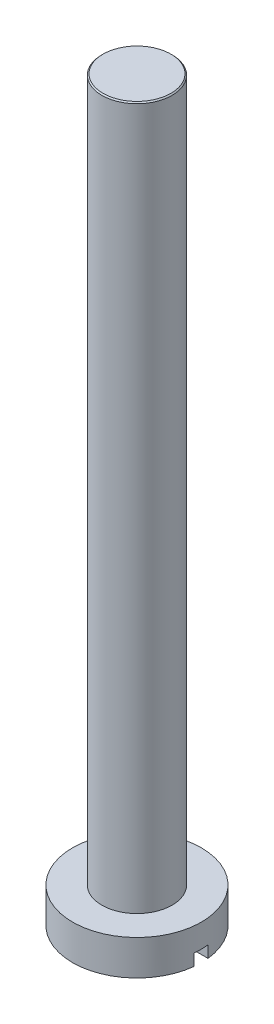
ISO-10303-21;
HEADER;
FILE_DESCRIPTION(('STEP AP214'),'2;1');
FILE_NAME('part.step','',(''),(''),'','','');
FILE_SCHEMA(('AUTOMOTIVE_DESIGN { 1 0 10303 214 1 1 1 1 }'));
ENDSEC;
DATA;
#1=APPLICATION_CONTEXT('core data for automotive mechanical design processes');
#2=APPLICATION_PROTOCOL_DEFINITION('international standard','automotive_design',2000,#1);
#3=PRODUCT_CONTEXT('',#1,'mechanical');
#4=PRODUCT('Part','Part','',(#3));
#5=PRODUCT_RELATED_PRODUCT_CATEGORY('part','',(#4));
#6=PRODUCT_DEFINITION_FORMATION('','',#4);
#7=PRODUCT_DEFINITION_CONTEXT('part definition',#1,'design');
#8=PRODUCT_DEFINITION('design','',#6,#7);
#9=PRODUCT_DEFINITION_SHAPE('','',#8);
#10=(LENGTH_UNIT() NAMED_UNIT(*) SI_UNIT(.MILLI.,.METRE.));
#11=(NAMED_UNIT(*) PLANE_ANGLE_UNIT() SI_UNIT($,.RADIAN.));
#12=(NAMED_UNIT(*) SI_UNIT($,.STERADIAN.) SOLID_ANGLE_UNIT());
#13=UNCERTAINTY_MEASURE_WITH_UNIT(LENGTH_MEASURE(1.E-05),#10,'distance_accuracy_value','');
#14=(GEOMETRIC_REPRESENTATION_CONTEXT(3) GLOBAL_UNCERTAINTY_ASSIGNED_CONTEXT((#13)) GLOBAL_UNIT_ASSIGNED_CONTEXT((#10,
#11,#12)) REPRESENTATION_CONTEXT('',''));
#15=CARTESIAN_POINT('',(0.,0.,0.));
#16=DIRECTION('',(0.,0.,1.));
#17=DIRECTION('',(1.,0.,0.));
#18=AXIS2_PLACEMENT_3D('',#15,#16,#17);
#19=CARTESIAN_POINT('',(0.,-1.5,0.));
#20=DIRECTION('',(0.,-1.,0.));
#21=DIRECTION('',(0.,0.,-1.));
#22=AXIS2_PLACEMENT_3D('',#19,#20,#21);
#23=PLANE('',#22);
#24=DIRECTION('',(1.,0.,0.));
#25=VECTOR('',#24,1.);
#26=CARTESIAN_POINT('',(0.,-1.5,-0.3));
#27=LINE('',#26,#25);
#28=CARTESIAN_POINT('',(-2.73358738656733,-1.5,-0.3));
#29=VERTEX_POINT('',#28);
#30=CARTESIAN_POINT('',(2.73358738656733,-1.5,-0.3));
#31=VERTEX_POINT('',#30);
#32=EDGE_CURVE('E94',#29,#31,#27,.T.);
#33=ORIENTED_EDGE('',*,*,#32,.F.);
#34=CARTESIAN_POINT('',(0.,-1.5,0.));
#35=DIRECTION('',(0.,-1.,0.));
#36=DIRECTION('',(0.,0.,-1.));
#37=AXIS2_PLACEMENT_3D('',#34,#35,#36);
#38=CIRCLE('',#37,2.75);
#39=EDGE_CURVE('E104',#29,#31,#38,.T.);
#40=ORIENTED_EDGE('',*,*,#39,.T.);
#41=EDGE_LOOP('',(#33,#40));
#42=FACE_BOUND('',#41,.T.);
#43=ADVANCED_FACE('F46',(#42),#23,.T.);
#44=CARTESIAN_POINT('',(0.,-1.5,0.));
#45=DIRECTION('',(0.,1.,0.));
#46=DIRECTION('',(0.,0.,1.));
#47=AXIS2_PLACEMENT_3D('',#44,#45,#46);
#48=CYLINDRICAL_SURFACE('',#47,2.75);
#49=CARTESIAN_POINT('',(0.,-1.,0.));
#50=DIRECTION('',(0.,1.,0.));
#51=DIRECTION('',(0.,0.,1.));
#52=AXIS2_PLACEMENT_3D('',#49,#50,#51);
#53=CIRCLE('',#52,2.75);
#54=CARTESIAN_POINT('',(2.73358738656733,-1.,0.3));
#55=VERTEX_POINT('',#54);
#56=CARTESIAN_POINT('',(2.73358738656733,-1.,-0.3));
#57=VERTEX_POINT('',#56);
#58=EDGE_CURVE('E12',#55,#57,#53,.T.);
#59=ORIENTED_EDGE('',*,*,#58,.T.);
#60=DIRECTION('',(0.,1.,0.));
#61=VECTOR('',#60,1.);
#62=CARTESIAN_POINT('',(2.73358738656733,-1.5,-0.3));
#63=LINE('',#62,#61);
#64=EDGE_CURVE('E69',#57,#31,#63,.F.);
#65=ORIENTED_EDGE('',*,*,#64,.T.);
#66=ORIENTED_EDGE('',*,*,#39,.F.);
#67=DIRECTION('',(0.,1.,0.));
#68=VECTOR('',#67,1.);
#69=CARTESIAN_POINT('',(-2.73358738656733,-1.5,-0.3));
#70=LINE('',#69,#68);
#71=CARTESIAN_POINT('',(-2.73358738656733,-1.,-0.3));
#72=VERTEX_POINT('',#71);
#73=EDGE_CURVE('E110',#29,#72,#70,.T.);
#74=ORIENTED_EDGE('',*,*,#73,.T.);
#75=CARTESIAN_POINT('',(-2.73358738656733,-1.,0.3));
#76=VERTEX_POINT('',#75);
#77=EDGE_CURVE('E50',#72,#76,#53,.T.);
#78=ORIENTED_EDGE('',*,*,#77,.T.);
#79=DIRECTION('',(0.,1.,0.));
#80=VECTOR('',#79,1.);
#81=CARTESIAN_POINT('',(-2.73358738656733,-1.5,0.3));
#82=LINE('',#81,#80);
#83=CARTESIAN_POINT('',(-2.73358738656733,-1.5,0.3));
#84=VERTEX_POINT('',#83);
#85=EDGE_CURVE('E89',#76,#84,#82,.F.);
#86=ORIENTED_EDGE('',*,*,#85,.T.);
#87=CARTESIAN_POINT('',(2.73358738656733,-1.5,0.3));
#88=VERTEX_POINT('',#87);
#89=EDGE_CURVE('E95',#88,#84,#38,.T.);
#90=ORIENTED_EDGE('',*,*,#89,.F.);
#91=DIRECTION('',(0.,1.,0.));
#92=VECTOR('',#91,1.);
#93=CARTESIAN_POINT('',(2.73358738656733,-1.5,0.3));
#94=LINE('',#93,#92);
#95=EDGE_CURVE('E61',#88,#55,#94,.T.);
#96=ORIENTED_EDGE('',*,*,#95,.T.);
#97=EDGE_LOOP('',(#59,#65,#66,#74,#78,#86,#90,#96));
#98=FACE_BOUND('',#97,.T.);
#99=CARTESIAN_POINT('',(0.,0.,0.));
#100=DIRECTION('',(0.,-1.,0.));
#101=DIRECTION('',(0.,0.,-1.));
#102=AXIS2_PLACEMENT_3D('',#99,#100,#101);
#103=CIRCLE('',#102,2.75);
#104=CARTESIAN_POINT('',(0.,0.,-2.75));
#105=VERTEX_POINT('',#104);
#106=EDGE_CURVE('E107',#105,#105,#103,.T.);
#107=ORIENTED_EDGE('',*,*,#106,.T.);
#108=EDGE_LOOP('',(#107));
#109=FACE_BOUND('',#108,.T.);
#110=ADVANCED_FACE('F48',(#98,#109),#48,.T.);
#111=DIRECTION('',(-1.,0.,0.));
#112=VECTOR('',#111,1.);
#113=CARTESIAN_POINT('',(0.,-1.5,0.3));
#114=LINE('',#113,#112);
#115=EDGE_CURVE('E86',#88,#84,#114,.T.);
#116=ORIENTED_EDGE('',*,*,#115,.F.);
#117=ORIENTED_EDGE('',*,*,#89,.T.);
#118=EDGE_LOOP('',(#116,#117));
#119=FACE_BOUND('',#118,.T.);
#120=ADVANCED_FACE('F103',(#119),#23,.T.);
#121=CARTESIAN_POINT('',(0.,0.,0.));
#122=DIRECTION('',(0.,-1.,0.));
#123=DIRECTION('',(0.,0.,-1.));
#124=AXIS2_PLACEMENT_3D('',#121,#122,#123);
#125=PLANE('',#124);
#126=ORIENTED_EDGE('',*,*,#106,.F.);
#127=EDGE_LOOP('',(#126));
#128=FACE_BOUND('',#127,.T.);
#129=ADVANCED_FACE('F124',(#128),#125,.F.);
#130=CARTESIAN_POINT('',(0.,-1.,0.));
#131=DIRECTION('',(0.,1.,0.));
#132=DIRECTION('',(0.,0.,1.));
#133=AXIS2_PLACEMENT_3D('',#130,#131,#132);
#134=PLANE('',#133);
#135=DIRECTION('',(-1.,0.,0.));
#136=VECTOR('',#135,1.);
#137=CARTESIAN_POINT('',(-4.09817586391625,-1.,0.3));
#138=LINE('',#137,#136);
#139=EDGE_CURVE('E175',#55,#76,#138,.T.);
#140=ORIENTED_EDGE('',*,*,#139,.T.);
#141=ORIENTED_EDGE('',*,*,#77,.F.);
#142=DIRECTION('',(1.,0.,0.));
#143=VECTOR('',#142,1.);
#144=CARTESIAN_POINT('',(-4.09817586391625,-1.,-0.3));
#145=LINE('',#144,#143);
#146=EDGE_CURVE('E101',#72,#57,#145,.T.);
#147=ORIENTED_EDGE('',*,*,#146,.T.);
#148=ORIENTED_EDGE('',*,*,#58,.F.);
#149=EDGE_LOOP('',(#140,#141,#147,#148));
#150=FACE_BOUND('',#149,.T.);
#151=ADVANCED_FACE('F128',(#150),#134,.F.);
#152=CARTESIAN_POINT('',(-4.09817586391625,-1.,-0.3));
#153=DIRECTION('',(0.,0.,-1.));
#154=DIRECTION('',(-1.,0.,0.));
#155=AXIS2_PLACEMENT_3D('',#152,#153,#154);
#156=PLANE('',#155);
#157=ORIENTED_EDGE('',*,*,#32,.T.);
#158=ORIENTED_EDGE('',*,*,#64,.F.);
#159=ORIENTED_EDGE('',*,*,#146,.F.);
#160=ORIENTED_EDGE('',*,*,#73,.F.);
#161=EDGE_LOOP('',(#157,#158,#159,#160));
#162=FACE_BOUND('',#161,.T.);
#163=ADVANCED_FACE('F114',(#162),#156,.F.);
#164=CARTESIAN_POINT('',(-4.09817586391625,-1.,0.3));
#165=DIRECTION('',(0.,0.,1.));
#166=DIRECTION('',(1.,0.,0.));
#167=AXIS2_PLACEMENT_3D('',#164,#165,#166);
#168=PLANE('',#167);
#169=ORIENTED_EDGE('',*,*,#115,.T.);
#170=ORIENTED_EDGE('',*,*,#85,.F.);
#171=ORIENTED_EDGE('',*,*,#139,.F.);
#172=ORIENTED_EDGE('',*,*,#95,.F.);
#173=EDGE_LOOP('',(#169,#170,#171,#172));
#174=FACE_BOUND('',#173,.T.);
#175=ADVANCED_FACE('F88',(#174),#168,.F.);
#176=CLOSED_SHELL('',(#43,#110,#120,#129,#151,#163,#175));
#177=MANIFOLD_SOLID_BREP('B2',#176);
#178=CARTESIAN_POINT('',(0.,30.,0.));
#179=DIRECTION('',(0.,-1.,0.));
#180=DIRECTION('',(0.,0.,-1.));
#181=AXIS2_PLACEMENT_3D('',#178,#179,#180);
#182=CYLINDRICAL_SURFACE('',#181,1.5);
#183=CARTESIAN_POINT('',(0.,29.95,0.));
#184=DIRECTION('',(0.,1.,0.));
#185=DIRECTION('',(0.,0.,1.));
#186=AXIS2_PLACEMENT_3D('',#183,#184,#185);
#187=CIRCLE('',#186,1.5);
#188=CARTESIAN_POINT('',(0.,29.95,1.5));
#189=VERTEX_POINT('',#188);
#190=EDGE_CURVE('E45',#189,#189,#187,.F.);
#191=ORIENTED_EDGE('',*,*,#190,.T.);
#192=EDGE_LOOP('',(#191));
#193=FACE_BOUND('',#192,.T.);
#194=CARTESIAN_POINT('',(0.,0.,0.));
#195=DIRECTION('',(0.,1.,0.));
#196=DIRECTION('',(0.,0.,1.));
#197=AXIS2_PLACEMENT_3D('',#194,#195,#196);
#198=CIRCLE('',#197,1.5);
#199=CARTESIAN_POINT('',(0.,0.,1.5));
#200=VERTEX_POINT('',#199);
#201=EDGE_CURVE('E192',#200,#200,#198,.T.);
#202=ORIENTED_EDGE('',*,*,#201,.T.);
#203=EDGE_LOOP('',(#202));
#204=FACE_BOUND('',#203,.T.);
#205=ADVANCED_FACE('F181',(#193,#204),#182,.T.);
#206=CARTESIAN_POINT('',(0.,30.,0.));
#207=DIRECTION('',(0.,1.,0.));
#208=DIRECTION('',(0.,0.,1.));
#209=AXIS2_PLACEMENT_3D('',#206,#207,#208);
#210=PLANE('',#209);
#211=CARTESIAN_POINT('',(0.,30.,0.));
#212=DIRECTION('',(0.,1.,0.));
#213=DIRECTION('',(0.,0.,1.));
#214=AXIS2_PLACEMENT_3D('',#211,#212,#213);
#215=CIRCLE('',#214,1.45);
#216=CARTESIAN_POINT('',(0.,30.,1.45));
#217=VERTEX_POINT('',#216);
#218=EDGE_CURVE('E188',#217,#217,#215,.T.);
#219=ORIENTED_EDGE('',*,*,#218,.T.);
#220=EDGE_LOOP('',(#219));
#221=FACE_BOUND('',#220,.T.);
#222=ADVANCED_FACE('F202',(#221),#210,.T.);
#223=CARTESIAN_POINT('',(0.,0.,0.));
#224=DIRECTION('',(0.,1.,0.));
#225=DIRECTION('',(0.,0.,1.));
#226=AXIS2_PLACEMENT_3D('',#223,#224,#225);
#227=PLANE('',#226);
#228=ORIENTED_EDGE('',*,*,#201,.F.);
#229=EDGE_LOOP('',(#228));
#230=FACE_BOUND('',#229,.T.);
#231=ADVANCED_FACE('F200',(#230),#227,.F.);
#232=CARTESIAN_POINT('',(0.,30.,0.));
#233=DIRECTION('',(0.,-1.,0.));
#234=DIRECTION('',(0.,0.,-1.));
#235=AXIS2_PLACEMENT_3D('',#232,#233,#234);
#236=CONICAL_SURFACE('',#235,1.45,0.78539816339744);
#237=ORIENTED_EDGE('',*,*,#190,.F.);
#238=EDGE_LOOP('',(#237));
#239=FACE_BOUND('',#238,.T.);
#240=ORIENTED_EDGE('',*,*,#218,.F.);
#241=EDGE_LOOP('',(#240));
#242=FACE_BOUND('',#241,.T.);
#243=ADVANCED_FACE('F183',(#239,#242),#236,.T.);
#244=CLOSED_SHELL('',(#205,#222,#231,#243));
#245=MANIFOLD_SOLID_BREP('B6',#244);
#246=ADVANCED_BREP_SHAPE_REPRESENTATION('',(#18,#177,#245),#14);
#247=SHAPE_DEFINITION_REPRESENTATION(#9,#246);
ENDSEC;
END-ISO-10303-21;
